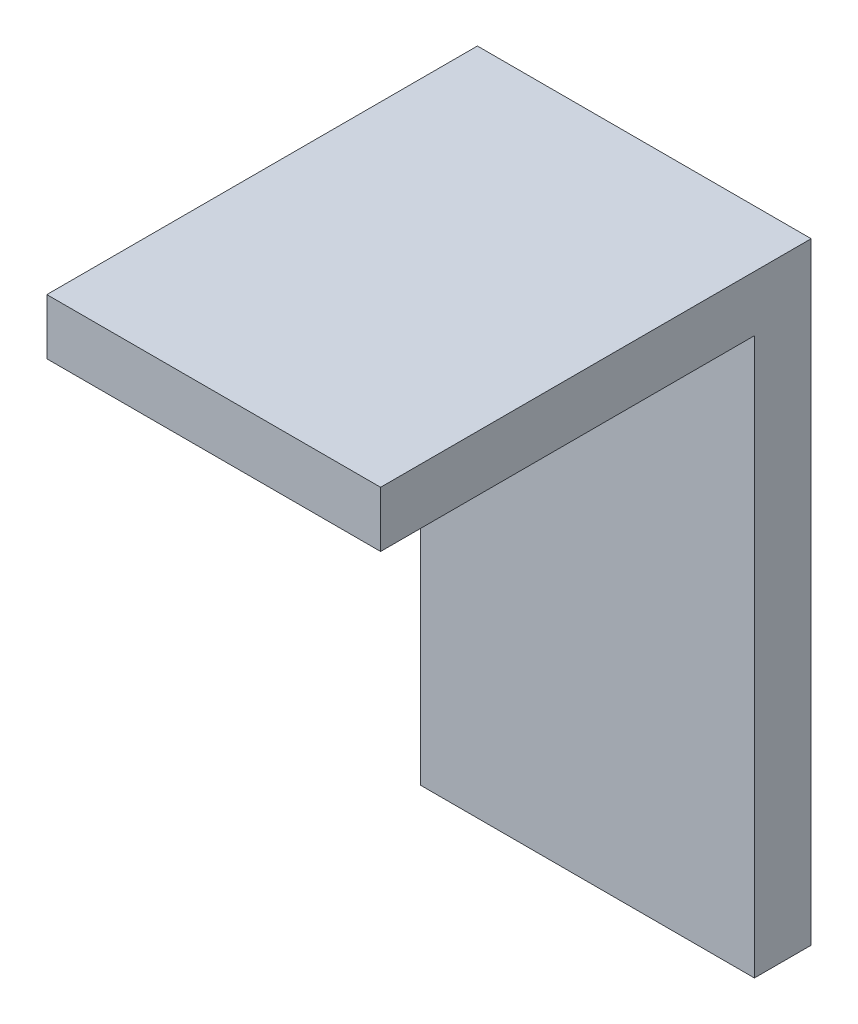
ISO-10303-21;
HEADER;
FILE_DESCRIPTION(('STEP AP214'),'2;1');
FILE_NAME('part.step','',(''),(''),'','','');
FILE_SCHEMA(('AUTOMOTIVE_DESIGN { 1 0 10303 214 1 1 1 1 }'));
ENDSEC;
DATA;
#1=APPLICATION_CONTEXT('core data for automotive mechanical design processes');
#2=APPLICATION_PROTOCOL_DEFINITION('international standard','automotive_design',2000,#1);
#3=PRODUCT_CONTEXT('',#1,'mechanical');
#4=PRODUCT('Part','Part','',(#3));
#5=PRODUCT_RELATED_PRODUCT_CATEGORY('part','',(#4));
#6=PRODUCT_DEFINITION_FORMATION('','',#4);
#7=PRODUCT_DEFINITION_CONTEXT('part definition',#1,'design');
#8=PRODUCT_DEFINITION('design','',#6,#7);
#9=PRODUCT_DEFINITION_SHAPE('','',#8);
#10=(LENGTH_UNIT() NAMED_UNIT(*) SI_UNIT(.MILLI.,.METRE.));
#11=(NAMED_UNIT(*) PLANE_ANGLE_UNIT() SI_UNIT($,.RADIAN.));
#12=(NAMED_UNIT(*) SI_UNIT($,.STERADIAN.) SOLID_ANGLE_UNIT());
#13=UNCERTAINTY_MEASURE_WITH_UNIT(LENGTH_MEASURE(1.E-05),#10,'distance_accuracy_value','');
#14=(GEOMETRIC_REPRESENTATION_CONTEXT(3) GLOBAL_UNCERTAINTY_ASSIGNED_CONTEXT((#13)) GLOBAL_UNIT_ASSIGNED_CONTEXT((#10,
#11,#12)) REPRESENTATION_CONTEXT('',''));
#15=CARTESIAN_POINT('',(0.,0.,0.));
#16=DIRECTION('',(0.,0.,1.));
#17=DIRECTION('',(1.,0.,0.));
#18=AXIS2_PLACEMENT_3D('',#15,#16,#17);
#19=CARTESIAN_POINT('',(-1.9,4.55,0.));
#20=DIRECTION('',(-1.,0.,0.));
#21=DIRECTION('',(0.,0.,1.));
#22=AXIS2_PLACEMENT_3D('',#19,#20,#21);
#23=PLANE('',#22);
#24=DIRECTION('',(0.,1.,0.));
#25=VECTOR('',#24,1.);
#26=CARTESIAN_POINT('',(-1.9,4.,0.));
#27=LINE('',#26,#25);
#28=CARTESIAN_POINT('',(-1.9,4.,0.));
#29=VERTEX_POINT('',#28);
#30=CARTESIAN_POINT('',(-1.9,4.55,0.));
#31=VERTEX_POINT('',#30);
#32=EDGE_CURVE('E11',#29,#31,#27,.T.);
#33=ORIENTED_EDGE('',*,*,#32,.F.);
#34=DIRECTION('',(0.,0.,-1.));
#35=VECTOR('',#34,1.);
#36=CARTESIAN_POINT('',(-1.9,4.,0.051));
#37=LINE('',#36,#35);
#38=CARTESIAN_POINT('',(-1.9,4.,0.051));
#39=VERTEX_POINT('',#38);
#40=EDGE_CURVE('E24',#39,#29,#37,.T.);
#41=ORIENTED_EDGE('',*,*,#40,.F.);
#42=DIRECTION('',(0.,-1.,0.));
#43=VECTOR('',#42,1.);
#44=CARTESIAN_POINT('',(-1.9,4.5,0.051));
#45=LINE('',#44,#43);
#46=CARTESIAN_POINT('',(-1.9,4.5,0.051));
#47=VERTEX_POINT('',#46);
#48=EDGE_CURVE('E87',#47,#39,#45,.T.);
#49=ORIENTED_EDGE('',*,*,#48,.F.);
#50=DIRECTION('',(0.,0.,-1.));
#51=VECTOR('',#50,1.);
#52=CARTESIAN_POINT('',(-1.9,4.5,0.387));
#53=LINE('',#52,#51);
#54=CARTESIAN_POINT('',(-1.9,4.5,0.387));
#55=VERTEX_POINT('',#54);
#56=EDGE_CURVE('E114',#55,#47,#53,.T.);
#57=ORIENTED_EDGE('',*,*,#56,.F.);
#58=DIRECTION('',(0.,-1.,0.));
#59=VECTOR('',#58,1.);
#60=CARTESIAN_POINT('',(-1.9,4.55,0.387));
#61=LINE('',#60,#59);
#62=CARTESIAN_POINT('',(-1.9,4.55,0.387));
#63=VERTEX_POINT('',#62);
#64=EDGE_CURVE('E111',#63,#55,#61,.T.);
#65=ORIENTED_EDGE('',*,*,#64,.F.);
#66=DIRECTION('',(0.,0.,1.));
#67=VECTOR('',#66,1.);
#68=CARTESIAN_POINT('',(-1.9,4.55,0.));
#69=LINE('',#68,#67);
#70=EDGE_CURVE('E108',#31,#63,#69,.T.);
#71=ORIENTED_EDGE('',*,*,#70,.F.);
#72=EDGE_LOOP('',(#33,#41,#49,#57,#65,#71));
#73=FACE_BOUND('',#72,.T.);
#74=ADVANCED_FACE('F17',(#73),#23,.T.);
#75=CARTESIAN_POINT('',(-1.6,4.,0.));
#76=DIRECTION('',(1.,0.,0.));
#77=DIRECTION('',(0.,0.,1.));
#78=AXIS2_PLACEMENT_3D('',#75,#76,#77);
#79=PLANE('',#78);
#80=DIRECTION('',(0.,-1.,0.));
#81=VECTOR('',#80,1.);
#82=CARTESIAN_POINT('',(-1.6,4.55,0.));
#83=LINE('',#82,#81);
#84=CARTESIAN_POINT('',(-1.6,4.55,0.));
#85=VERTEX_POINT('',#84);
#86=CARTESIAN_POINT('',(-1.6,4.,0.));
#87=VERTEX_POINT('',#86);
#88=EDGE_CURVE('E106',#85,#87,#83,.T.);
#89=ORIENTED_EDGE('',*,*,#88,.F.);
#90=DIRECTION('',(0.,0.,-1.));
#91=VECTOR('',#90,1.);
#92=CARTESIAN_POINT('',(-1.6,4.55,0.387));
#93=LINE('',#92,#91);
#94=CARTESIAN_POINT('',(-1.6,4.55,0.387));
#95=VERTEX_POINT('',#94);
#96=EDGE_CURVE('E103',#95,#85,#93,.T.);
#97=ORIENTED_EDGE('',*,*,#96,.F.);
#98=DIRECTION('',(0.,1.,0.));
#99=VECTOR('',#98,1.);
#100=CARTESIAN_POINT('',(-1.6,4.5,0.387));
#101=LINE('',#100,#99);
#102=CARTESIAN_POINT('',(-1.6,4.5,0.387));
#103=VERTEX_POINT('',#102);
#104=EDGE_CURVE('E100',#103,#95,#101,.T.);
#105=ORIENTED_EDGE('',*,*,#104,.F.);
#106=DIRECTION('',(0.,0.,1.));
#107=VECTOR('',#106,1.);
#108=CARTESIAN_POINT('',(-1.6,4.5,0.051));
#109=LINE('',#108,#107);
#110=CARTESIAN_POINT('',(-1.6,4.5,0.051));
#111=VERTEX_POINT('',#110);
#112=EDGE_CURVE('E72',#111,#103,#109,.T.);
#113=ORIENTED_EDGE('',*,*,#112,.F.);
#114=DIRECTION('',(0.,1.,0.));
#115=VECTOR('',#114,1.);
#116=CARTESIAN_POINT('',(-1.6,4.,0.051));
#117=LINE('',#116,#115);
#118=CARTESIAN_POINT('',(-1.6,4.,0.051));
#119=VERTEX_POINT('',#118);
#120=EDGE_CURVE('E66',#119,#111,#117,.T.);
#121=ORIENTED_EDGE('',*,*,#120,.F.);
#122=DIRECTION('',(0.,0.,1.));
#123=VECTOR('',#122,1.);
#124=CARTESIAN_POINT('',(-1.6,4.,0.));
#125=LINE('',#124,#123);
#126=EDGE_CURVE('E69',#87,#119,#125,.T.);
#127=ORIENTED_EDGE('',*,*,#126,.F.);
#128=EDGE_LOOP('',(#89,#97,#105,#113,#121,#127));
#129=FACE_BOUND('',#128,.T.);
#130=ADVANCED_FACE('F68',(#129),#79,.T.);
#131=CARTESIAN_POINT('',(-1.9,4.55,0.387));
#132=DIRECTION('',(0.,0.,1.));
#133=DIRECTION('',(0.,1.,0.));
#134=AXIS2_PLACEMENT_3D('',#131,#132,#133);
#135=PLANE('',#134);
#136=ORIENTED_EDGE('',*,*,#64,.T.);
#137=DIRECTION('',(-1.,0.,0.));
#138=VECTOR('',#137,1.);
#139=CARTESIAN_POINT('',(-1.6,4.5,0.387));
#140=LINE('',#139,#138);
#141=EDGE_CURVE('E83',#103,#55,#140,.T.);
#142=ORIENTED_EDGE('',*,*,#141,.F.);
#143=ORIENTED_EDGE('',*,*,#104,.T.);
#144=DIRECTION('',(1.,0.,0.));
#145=VECTOR('',#144,1.);
#146=CARTESIAN_POINT('',(-1.9,4.55,0.387));
#147=LINE('',#146,#145);
#148=EDGE_CURVE('E88',#63,#95,#147,.T.);
#149=ORIENTED_EDGE('',*,*,#148,.F.);
#150=EDGE_LOOP('',(#136,#142,#143,#149));
#151=FACE_BOUND('',#150,.T.);
#152=ADVANCED_FACE('F125',(#151),#135,.T.);
#153=CARTESIAN_POINT('',(-1.9,4.5,0.051));
#154=DIRECTION('',(0.,0.,1.));
#155=DIRECTION('',(0.,1.,0.));
#156=AXIS2_PLACEMENT_3D('',#153,#154,#155);
#157=PLANE('',#156);
#158=ORIENTED_EDGE('',*,*,#48,.T.);
#159=DIRECTION('',(-1.,0.,0.));
#160=VECTOR('',#159,1.);
#161=CARTESIAN_POINT('',(-1.6,4.,0.051));
#162=LINE('',#161,#160);
#163=EDGE_CURVE('E81',#119,#39,#162,.T.);
#164=ORIENTED_EDGE('',*,*,#163,.F.);
#165=ORIENTED_EDGE('',*,*,#120,.T.);
#166=DIRECTION('',(1.,0.,0.));
#167=VECTOR('',#166,1.);
#168=CARTESIAN_POINT('',(-1.9,4.5,0.051));
#169=LINE('',#168,#167);
#170=EDGE_CURVE('E89',#47,#111,#169,.T.);
#171=ORIENTED_EDGE('',*,*,#170,.F.);
#172=EDGE_LOOP('',(#158,#164,#165,#171));
#173=FACE_BOUND('',#172,.T.);
#174=ADVANCED_FACE('F86',(#173),#157,.T.);
#175=CARTESIAN_POINT('',(-1.6,4.55,0.));
#176=DIRECTION('',(0.,1.,0.));
#177=DIRECTION('',(0.,0.,1.));
#178=AXIS2_PLACEMENT_3D('',#175,#176,#177);
#179=PLANE('',#178);
#180=DIRECTION('',(1.,0.,0.));
#181=VECTOR('',#180,1.);
#182=CARTESIAN_POINT('',(-1.9,4.55,0.));
#183=LINE('',#182,#181);
#184=EDGE_CURVE('E93',#31,#85,#183,.T.);
#185=ORIENTED_EDGE('',*,*,#184,.F.);
#186=ORIENTED_EDGE('',*,*,#70,.T.);
#187=ORIENTED_EDGE('',*,*,#148,.T.);
#188=ORIENTED_EDGE('',*,*,#96,.T.);
#189=EDGE_LOOP('',(#185,#186,#187,#188));
#190=FACE_BOUND('',#189,.T.);
#191=ADVANCED_FACE('F121',(#190),#179,.T.);
#192=CARTESIAN_POINT('',(-1.9,4.,0.));
#193=DIRECTION('',(0.,-1.,0.));
#194=DIRECTION('',(0.,0.,1.));
#195=AXIS2_PLACEMENT_3D('',#192,#193,#194);
#196=PLANE('',#195);
#197=DIRECTION('',(-1.,0.,0.));
#198=VECTOR('',#197,1.);
#199=CARTESIAN_POINT('',(-1.6,4.,0.));
#200=LINE('',#199,#198);
#201=EDGE_CURVE('E82',#87,#29,#200,.T.);
#202=ORIENTED_EDGE('',*,*,#201,.F.);
#203=ORIENTED_EDGE('',*,*,#126,.T.);
#204=ORIENTED_EDGE('',*,*,#163,.T.);
#205=ORIENTED_EDGE('',*,*,#40,.T.);
#206=EDGE_LOOP('',(#202,#203,#204,#205));
#207=FACE_BOUND('',#206,.T.);
#208=ADVANCED_FACE('F80',(#207),#196,.T.);
#209=CARTESIAN_POINT('',(-1.9,4.5,0.051));
#210=DIRECTION('',(0.,-1.,0.));
#211=DIRECTION('',(0.,0.,1.));
#212=AXIS2_PLACEMENT_3D('',#209,#210,#211);
#213=PLANE('',#212);
#214=ORIENTED_EDGE('',*,*,#170,.T.);
#215=ORIENTED_EDGE('',*,*,#112,.T.);
#216=ORIENTED_EDGE('',*,*,#141,.T.);
#217=ORIENTED_EDGE('',*,*,#56,.T.);
#218=EDGE_LOOP('',(#214,#215,#216,#217));
#219=FACE_BOUND('',#218,.T.);
#220=ADVANCED_FACE('F127',(#219),#213,.T.);
#221=CARTESIAN_POINT('',(-1.6,4.55,0.));
#222=DIRECTION('',(0.,0.,-1.));
#223=DIRECTION('',(0.,1.,0.));
#224=AXIS2_PLACEMENT_3D('',#221,#222,#223);
#225=PLANE('',#224);
#226=ORIENTED_EDGE('',*,*,#88,.T.);
#227=ORIENTED_EDGE('',*,*,#201,.T.);
#228=ORIENTED_EDGE('',*,*,#32,.T.);
#229=ORIENTED_EDGE('',*,*,#184,.T.);
#230=EDGE_LOOP('',(#226,#227,#228,#229));
#231=FACE_BOUND('',#230,.T.);
#232=ADVANCED_FACE('F117',(#231),#225,.T.);
#233=CLOSED_SHELL('',(#74,#130,#152,#174,#191,#208,#220,#232));
#234=MANIFOLD_SOLID_BREP('B1',#233);
#235=ADVANCED_BREP_SHAPE_REPRESENTATION('',(#18,#234),#14);
#236=SHAPE_DEFINITION_REPRESENTATION(#9,#235);
ENDSEC;
END-ISO-10303-21;
